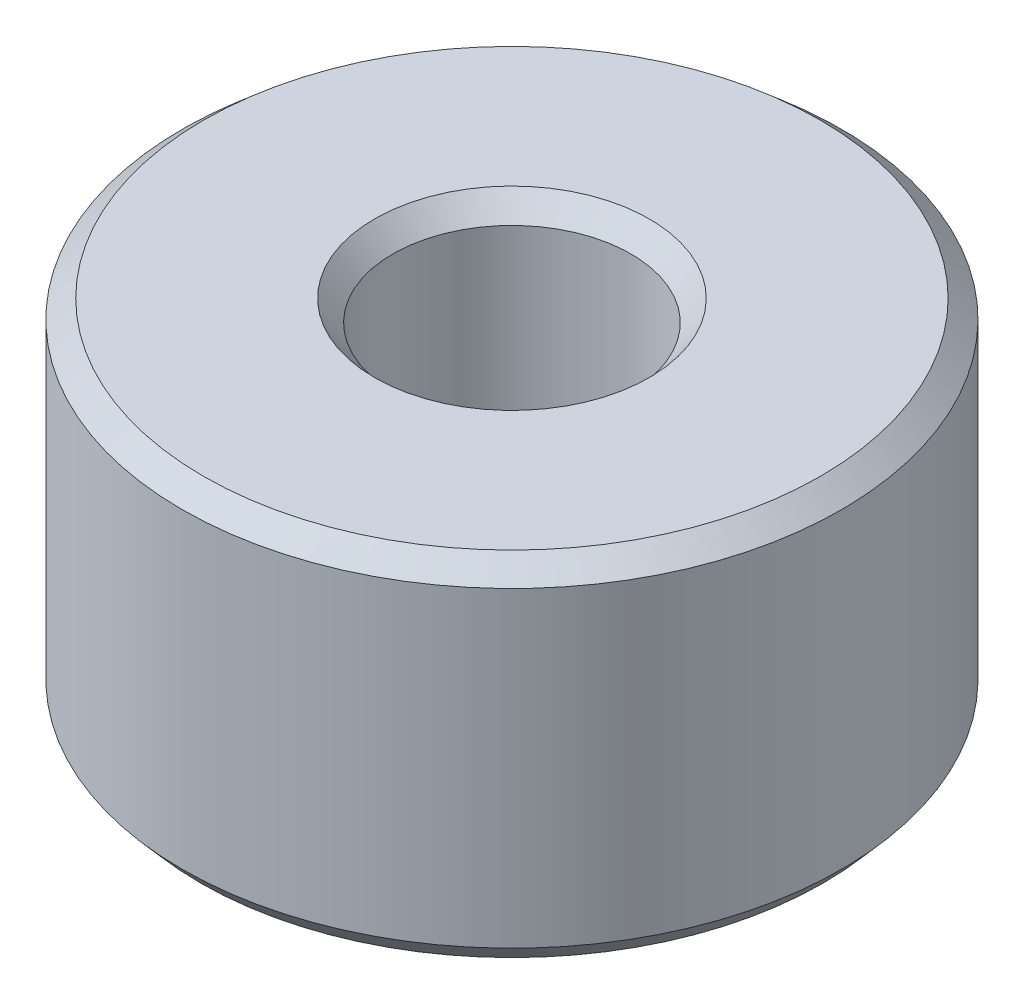
ISO-10303-21;
HEADER;
FILE_DESCRIPTION(('STEP AP214'),'2;1');
FILE_NAME('part.step','',(''),(''),'','','');
FILE_SCHEMA(('AUTOMOTIVE_DESIGN { 1 0 10303 214 1 1 1 1 }'));
ENDSEC;
DATA;
#1=APPLICATION_CONTEXT('core data for automotive mechanical design processes');
#2=APPLICATION_PROTOCOL_DEFINITION('international standard','automotive_design',2000,#1);
#3=PRODUCT_CONTEXT('',#1,'mechanical');
#4=PRODUCT('Part','Part','',(#3));
#5=PRODUCT_RELATED_PRODUCT_CATEGORY('part','',(#4));
#6=PRODUCT_DEFINITION_FORMATION('','',#4);
#7=PRODUCT_DEFINITION_CONTEXT('part definition',#1,'design');
#8=PRODUCT_DEFINITION('design','',#6,#7);
#9=PRODUCT_DEFINITION_SHAPE('','',#8);
#10=(LENGTH_UNIT() NAMED_UNIT(*) SI_UNIT(.MILLI.,.METRE.));
#11=(NAMED_UNIT(*) PLANE_ANGLE_UNIT() SI_UNIT($,.RADIAN.));
#12=(NAMED_UNIT(*) SI_UNIT($,.STERADIAN.) SOLID_ANGLE_UNIT());
#13=UNCERTAINTY_MEASURE_WITH_UNIT(LENGTH_MEASURE(1.E-05),#10,'distance_accuracy_value','');
#14=(GEOMETRIC_REPRESENTATION_CONTEXT(3) GLOBAL_UNCERTAINTY_ASSIGNED_CONTEXT((#13)) GLOBAL_UNIT_ASSIGNED_CONTEXT((#10,
#11,#12)) REPRESENTATION_CONTEXT('',''));
#15=CARTESIAN_POINT('',(0.,0.,0.));
#16=DIRECTION('',(0.,0.,1.));
#17=DIRECTION('',(1.,0.,0.));
#18=AXIS2_PLACEMENT_3D('',#15,#16,#17);
#19=CARTESIAN_POINT('',(0.,18.6360031514947,0.));
#20=DIRECTION('',(0.,-1.,0.));
#21=DIRECTION('',(0.,0.,-1.));
#22=AXIS2_PLACEMENT_3D('',#19,#20,#21);
#23=CYLINDRICAL_SURFACE('',#22,17.5);
#24=CARTESIAN_POINT('',(0.,1.12099520723811,0.));
#25=DIRECTION('',(0.,1.,0.));
#26=DIRECTION('',(0.,0.,1.));
#27=AXIS2_PLACEMENT_3D('',#24,#25,#26);
#28=CIRCLE('',#27,17.5);
#29=CARTESIAN_POINT('',(0.,1.12099520723811,17.5));
#30=VERTEX_POINT('',#29);
#31=EDGE_CURVE('E10',#30,#30,#28,.T.);
#32=ORIENTED_EDGE('',*,*,#31,.T.);
#33=EDGE_LOOP('',(#32));
#34=FACE_BOUND('',#33,.T.);
#35=CARTESIAN_POINT('',(0.,17.6611538349997,0.));
#36=DIRECTION('',(0.,1.,0.));
#37=DIRECTION('',(0.,0.,1.));
#38=AXIS2_PLACEMENT_3D('',#35,#36,#37);
#39=CIRCLE('',#38,17.5);
#40=CARTESIAN_POINT('',(0.,17.6611538349997,17.5));
#41=VERTEX_POINT('',#40);
#42=EDGE_CURVE('E50',#41,#41,#39,.F.);
#43=ORIENTED_EDGE('',*,*,#42,.T.);
#44=EDGE_LOOP('',(#43));
#45=FACE_BOUND('',#44,.T.);
#46=ADVANCED_FACE('F39',(#34,#45),#23,.T.);
#47=CARTESIAN_POINT('',(0.,18.6360031514947,0.));
#48=DIRECTION('',(0.,1.,0.));
#49=DIRECTION('',(0.,0.,1.));
#50=AXIS2_PLACEMENT_3D('',#47,#48,#49);
#51=PLANE('',#50);
#52=CARTESIAN_POINT('',(0.,18.6360031514947,0.));
#53=DIRECTION('',(0.,1.,0.));
#54=DIRECTION('',(0.,0.,1.));
#55=AXIS2_PLACEMENT_3D('',#52,#53,#54);
#56=CIRCLE('',#55,7.29713223548315);
#57=CARTESIAN_POINT('',(0.,18.6360031514947,7.29713223548315));
#58=VERTEX_POINT('',#57);
#59=EDGE_CURVE('E58',#58,#58,#56,.F.);
#60=ORIENTED_EDGE('',*,*,#59,.T.);
#61=EDGE_LOOP('',(#60));
#62=FACE_BOUND('',#61,.T.);
#63=CARTESIAN_POINT('',(0.,18.6360031514947,0.));
#64=DIRECTION('',(0.,1.,0.));
#65=DIRECTION('',(0.,0.,1.));
#66=AXIS2_PLACEMENT_3D('',#63,#64,#65);
#67=CIRCLE('',#66,16.3790047927619);
#68=CARTESIAN_POINT('',(0.,18.6360031514947,16.3790047927619));
#69=VERTEX_POINT('',#68);
#70=EDGE_CURVE('E61',#69,#69,#67,.T.);
#71=ORIENTED_EDGE('',*,*,#70,.T.);
#72=EDGE_LOOP('',(#71));
#73=FACE_BOUND('',#72,.T.);
#74=ADVANCED_FACE('F88',(#62,#73),#51,.T.);
#75=CARTESIAN_POINT('',(0.,0.,0.));
#76=DIRECTION('',(0.,1.,0.));
#77=DIRECTION('',(0.,0.,1.));
#78=AXIS2_PLACEMENT_3D('',#75,#76,#77);
#79=PLANE('',#78);
#80=CARTESIAN_POINT('',(0.,0.,0.));
#81=DIRECTION('',(0.,1.,0.));
#82=DIRECTION('',(0.,0.,1.));
#83=AXIS2_PLACEMENT_3D('',#80,#81,#82);
#84=CIRCLE('',#83,7.44327812622628);
#85=CARTESIAN_POINT('',(0.,0.,7.44327812622628));
#86=VERTEX_POINT('',#85);
#87=EDGE_CURVE('E51',#86,#86,#84,.T.);
#88=ORIENTED_EDGE('',*,*,#87,.T.);
#89=EDGE_LOOP('',(#88));
#90=FACE_BOUND('',#89,.T.);
#91=CARTESIAN_POINT('',(0.,0.,0.));
#92=DIRECTION('',(0.,1.,0.));
#93=DIRECTION('',(0.,0.,1.));
#94=AXIS2_PLACEMENT_3D('',#91,#92,#93);
#95=CIRCLE('',#94,16.525150683505);
#96=CARTESIAN_POINT('',(0.,0.,16.525150683505));
#97=VERTEX_POINT('',#96);
#98=EDGE_CURVE('E54',#97,#97,#95,.F.);
#99=ORIENTED_EDGE('',*,*,#98,.T.);
#100=EDGE_LOOP('',(#99));
#101=FACE_BOUND('',#100,.T.);
#102=ADVANCED_FACE('F83',(#90,#101),#79,.F.);
#103=CARTESIAN_POINT('',(0.,18.6360031514947,0.));
#104=DIRECTION('',(0.,-1.,0.));
#105=DIRECTION('',(0.,0.,-1.));
#106=AXIS2_PLACEMENT_3D('',#103,#104,#105);
#107=CYLINDRICAL_SURFACE('',#106,6.32228291898818);
#108=CARTESIAN_POINT('',(0.,17.5150079442565,0.));
#109=DIRECTION('',(0.,1.,0.));
#110=DIRECTION('',(0.,0.,1.));
#111=AXIS2_PLACEMENT_3D('',#108,#109,#110);
#112=CIRCLE('',#111,6.32228291898818);
#113=CARTESIAN_POINT('',(0.,17.5150079442565,6.32228291898818));
#114=VERTEX_POINT('',#113);
#115=EDGE_CURVE('E67',#114,#114,#112,.T.);
#116=ORIENTED_EDGE('',*,*,#115,.T.);
#117=EDGE_LOOP('',(#116));
#118=FACE_BOUND('',#117,.T.);
#119=CARTESIAN_POINT('',(0.,0.974849316494962,0.));
#120=DIRECTION('',(0.,1.,0.));
#121=DIRECTION('',(0.,0.,1.));
#122=AXIS2_PLACEMENT_3D('',#119,#120,#121);
#123=CIRCLE('',#122,6.32228291898818);
#124=CARTESIAN_POINT('',(0.,0.974849316494962,6.32228291898818));
#125=VERTEX_POINT('',#124);
#126=EDGE_CURVE('E69',#125,#125,#123,.F.);
#127=ORIENTED_EDGE('',*,*,#126,.T.);
#128=EDGE_LOOP('',(#127));
#129=FACE_BOUND('',#128,.T.);
#130=ADVANCED_FACE('F71',(#118,#129),#107,.F.);
#131=CARTESIAN_POINT('',(0.,17.5150079442565,0.));
#132=DIRECTION('',(0.,1.,0.));
#133=DIRECTION('',(0.,0.,1.));
#134=AXIS2_PLACEMENT_3D('',#131,#132,#133);
#135=CONICAL_SURFACE('',#134,6.32228291898818,0.715779590973696);
#136=ORIENTED_EDGE('',*,*,#59,.F.);
#137=EDGE_LOOP('',(#136));
#138=FACE_BOUND('',#137,.T.);
#139=ORIENTED_EDGE('',*,*,#115,.F.);
#140=EDGE_LOOP('',(#139));
#141=FACE_BOUND('',#140,.T.);
#142=ADVANCED_FACE('F77',(#138,#141),#135,.F.);
#143=CARTESIAN_POINT('',(0.,0.,0.));
#144=DIRECTION('',(0.,-1.,0.));
#145=DIRECTION('',(0.,0.,-1.));
#146=AXIS2_PLACEMENT_3D('',#143,#144,#145);
#147=CONICAL_SURFACE('',#146,7.44327812622628,0.855016735821199);
#148=ORIENTED_EDGE('',*,*,#126,.F.);
#149=EDGE_LOOP('',(#148));
#150=FACE_BOUND('',#149,.T.);
#151=ORIENTED_EDGE('',*,*,#87,.F.);
#152=EDGE_LOOP('',(#151));
#153=FACE_BOUND('',#152,.T.);
#154=ADVANCED_FACE('F73',(#150,#153),#147,.F.);
#155=CARTESIAN_POINT('',(0.,1.12099520723811,0.));
#156=DIRECTION('',(0.,1.,0.));
#157=DIRECTION('',(0.,0.,1.));
#158=AXIS2_PLACEMENT_3D('',#155,#156,#157);
#159=CONICAL_SURFACE('',#158,17.5,0.715779590973695);
#160=ORIENTED_EDGE('',*,*,#98,.F.);
#161=EDGE_LOOP('',(#160));
#162=FACE_BOUND('',#161,.T.);
#163=ORIENTED_EDGE('',*,*,#31,.F.);
#164=EDGE_LOOP('',(#163));
#165=FACE_BOUND('',#164,.T.);
#166=ADVANCED_FACE('F76',(#162,#165),#159,.T.);
#167=CARTESIAN_POINT('',(0.,18.6360031514947,0.));
#168=DIRECTION('',(0.,-1.,0.));
#169=DIRECTION('',(0.,0.,-1.));
#170=AXIS2_PLACEMENT_3D('',#167,#168,#169);
#171=CONICAL_SURFACE('',#170,16.3790047927619,0.855016735821203);
#172=ORIENTED_EDGE('',*,*,#42,.F.);
#173=EDGE_LOOP('',(#172));
#174=FACE_BOUND('',#173,.T.);
#175=ORIENTED_EDGE('',*,*,#70,.F.);
#176=EDGE_LOOP('',(#175));
#177=FACE_BOUND('',#176,.T.);
#178=ADVANCED_FACE('F45',(#174,#177),#171,.T.);
#179=CLOSED_SHELL('',(#46,#74,#102,#130,#142,#154,#166,#178));
#180=MANIFOLD_SOLID_BREP('B2',#179);
#181=ADVANCED_BREP_SHAPE_REPRESENTATION('',(#18,#180),#14);
#182=SHAPE_DEFINITION_REPRESENTATION(#9,#181);
ENDSEC;
END-ISO-10303-21;
